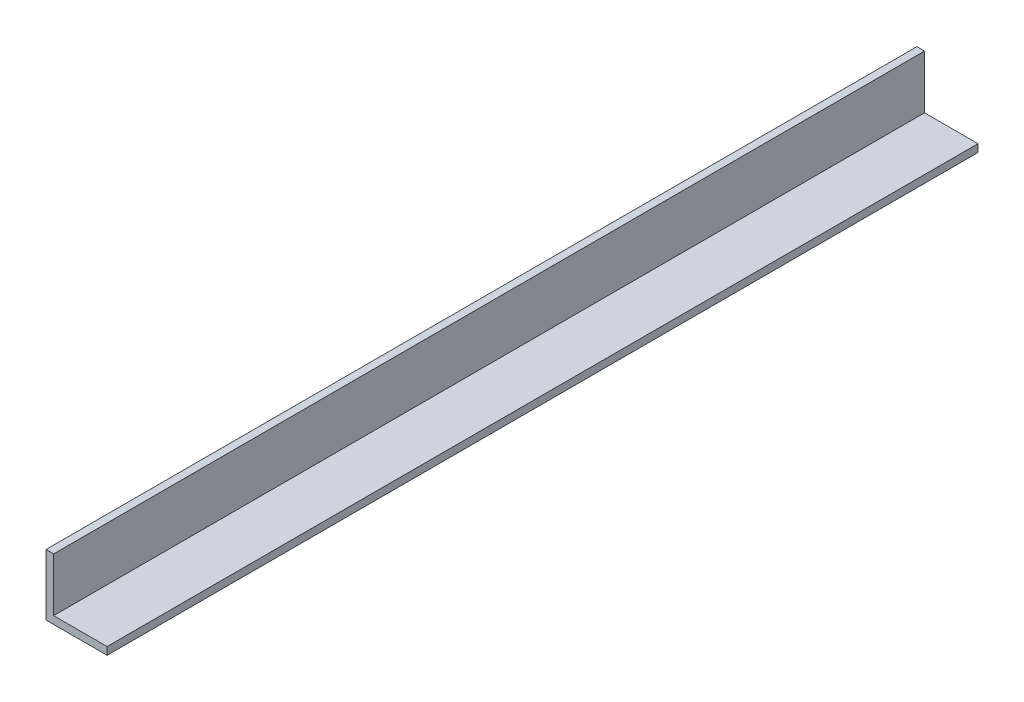
ISO-10303-21;
HEADER;
FILE_DESCRIPTION(('STEP AP214'),'2;1');
FILE_NAME('part.step','',(''),(''),'','','');
FILE_SCHEMA(('AUTOMOTIVE_DESIGN { 1 0 10303 214 1 1 1 1 }'));
ENDSEC;
DATA;
#1=APPLICATION_CONTEXT('core data for automotive mechanical design processes');
#2=APPLICATION_PROTOCOL_DEFINITION('international standard','automotive_design',2000,#1);
#3=PRODUCT_CONTEXT('',#1,'mechanical');
#4=PRODUCT('Part','Part','',(#3));
#5=PRODUCT_RELATED_PRODUCT_CATEGORY('part','',(#4));
#6=PRODUCT_DEFINITION_FORMATION('','',#4);
#7=PRODUCT_DEFINITION_CONTEXT('part definition',#1,'design');
#8=PRODUCT_DEFINITION('design','',#6,#7);
#9=PRODUCT_DEFINITION_SHAPE('','',#8);
#10=(LENGTH_UNIT() NAMED_UNIT(*) SI_UNIT(.MILLI.,.METRE.));
#11=(NAMED_UNIT(*) PLANE_ANGLE_UNIT() SI_UNIT($,.RADIAN.));
#12=(NAMED_UNIT(*) SI_UNIT($,.STERADIAN.) SOLID_ANGLE_UNIT());
#13=UNCERTAINTY_MEASURE_WITH_UNIT(LENGTH_MEASURE(1.E-05),#10,'distance_accuracy_value','');
#14=(GEOMETRIC_REPRESENTATION_CONTEXT(3) GLOBAL_UNCERTAINTY_ASSIGNED_CONTEXT((#13)) GLOBAL_UNIT_ASSIGNED_CONTEXT((#10,
#11,#12)) REPRESENTATION_CONTEXT('',''));
#15=CARTESIAN_POINT('',(0.,0.,0.));
#16=DIRECTION('',(0.,0.,1.));
#17=DIRECTION('',(1.,0.,0.));
#18=AXIS2_PLACEMENT_3D('',#15,#16,#17);
#19=CARTESIAN_POINT('',(3.175,25.4,180.975));
#20=DIRECTION('',(0.,-1.,0.));
#21=DIRECTION('',(0.,0.,-1.));
#22=AXIS2_PLACEMENT_3D('',#19,#20,#21);
#23=PLANE('',#22);
#24=DIRECTION('',(-1.,0.,0.));
#25=VECTOR('',#24,1.);
#26=CARTESIAN_POINT('',(3.175,25.4,-180.975));
#27=LINE('',#26,#25);
#28=CARTESIAN_POINT('',(3.175,25.4,-180.975));
#29=VERTEX_POINT('',#28);
#30=CARTESIAN_POINT('',(0.,25.4,-180.975));
#31=VERTEX_POINT('',#30);
#32=EDGE_CURVE('E125',#29,#31,#27,.T.);
#33=ORIENTED_EDGE('',*,*,#32,.T.);
#34=DIRECTION('',(0.,0.,-1.));
#35=VECTOR('',#34,1.);
#36=CARTESIAN_POINT('',(0.,25.4,180.975));
#37=LINE('',#36,#35);
#38=CARTESIAN_POINT('',(0.,25.4,180.975));
#39=VERTEX_POINT('',#38);
#40=EDGE_CURVE('E11',#39,#31,#37,.T.);
#41=ORIENTED_EDGE('',*,*,#40,.F.);
#42=DIRECTION('',(-1.,0.,0.));
#43=VECTOR('',#42,1.);
#44=CARTESIAN_POINT('',(3.175,25.4,180.975));
#45=LINE('',#44,#43);
#46=CARTESIAN_POINT('',(3.175,25.4,180.975));
#47=VERTEX_POINT('',#46);
#48=EDGE_CURVE('E135',#47,#39,#45,.T.);
#49=ORIENTED_EDGE('',*,*,#48,.F.);
#50=DIRECTION('',(0.,0.,-1.));
#51=VECTOR('',#50,1.);
#52=CARTESIAN_POINT('',(3.175,25.4,180.975));
#53=LINE('',#52,#51);
#54=EDGE_CURVE('E121',#47,#29,#53,.T.);
#55=ORIENTED_EDGE('',*,*,#54,.T.);
#56=EDGE_LOOP('',(#33,#41,#49,#55));
#57=FACE_BOUND('',#56,.T.);
#58=ADVANCED_FACE('F41',(#57),#23,.F.);
#59=CARTESIAN_POINT('',(0.,25.4,180.975));
#60=DIRECTION('',(1.,0.,0.));
#61=DIRECTION('',(0.,0.,-1.));
#62=AXIS2_PLACEMENT_3D('',#59,#60,#61);
#63=PLANE('',#62);
#64=DIRECTION('',(0.,-1.,0.));
#65=VECTOR('',#64,1.);
#66=CARTESIAN_POINT('',(0.,25.4,-180.975));
#67=LINE('',#66,#65);
#68=CARTESIAN_POINT('',(0.,0.,-180.975));
#69=VERTEX_POINT('',#68);
#70=EDGE_CURVE('E128',#31,#69,#67,.T.);
#71=ORIENTED_EDGE('',*,*,#70,.T.);
#72=DIRECTION('',(0.,0.,-1.));
#73=VECTOR('',#72,1.);
#74=CARTESIAN_POINT('',(0.,0.,180.975));
#75=LINE('',#74,#73);
#76=CARTESIAN_POINT('',(0.,0.,180.975));
#77=VERTEX_POINT('',#76);
#78=EDGE_CURVE('E49',#77,#69,#75,.T.);
#79=ORIENTED_EDGE('',*,*,#78,.F.);
#80=DIRECTION('',(0.,-1.,0.));
#81=VECTOR('',#80,1.);
#82=CARTESIAN_POINT('',(0.,25.4,180.975));
#83=LINE('',#82,#81);
#84=EDGE_CURVE('E94',#39,#77,#83,.T.);
#85=ORIENTED_EDGE('',*,*,#84,.F.);
#86=ORIENTED_EDGE('',*,*,#40,.T.);
#87=EDGE_LOOP('',(#71,#79,#85,#86));
#88=FACE_BOUND('',#87,.T.);
#89=ADVANCED_FACE('F159',(#88),#63,.F.);
#90=CARTESIAN_POINT('',(0.,0.,180.975));
#91=DIRECTION('',(0.,1.,0.));
#92=DIRECTION('',(0.,0.,1.));
#93=AXIS2_PLACEMENT_3D('',#90,#91,#92);
#94=PLANE('',#93);
#95=DIRECTION('',(1.,0.,0.));
#96=VECTOR('',#95,1.);
#97=CARTESIAN_POINT('',(0.,0.,-180.975));
#98=LINE('',#97,#96);
#99=CARTESIAN_POINT('',(25.4,0.,-180.975));
#100=VERTEX_POINT('',#99);
#101=EDGE_CURVE('E130',#69,#100,#98,.T.);
#102=ORIENTED_EDGE('',*,*,#101,.T.);
#103=DIRECTION('',(0.,0.,-1.));
#104=VECTOR('',#103,1.);
#105=CARTESIAN_POINT('',(25.4,0.,180.975));
#106=LINE('',#105,#104);
#107=CARTESIAN_POINT('',(25.4,0.,180.975));
#108=VERTEX_POINT('',#107);
#109=EDGE_CURVE('E116',#108,#100,#106,.T.);
#110=ORIENTED_EDGE('',*,*,#109,.F.);
#111=DIRECTION('',(1.,0.,0.));
#112=VECTOR('',#111,1.);
#113=CARTESIAN_POINT('',(0.,0.,180.975));
#114=LINE('',#113,#112);
#115=EDGE_CURVE('E107',#77,#108,#114,.T.);
#116=ORIENTED_EDGE('',*,*,#115,.F.);
#117=ORIENTED_EDGE('',*,*,#78,.T.);
#118=EDGE_LOOP('',(#102,#110,#116,#117));
#119=FACE_BOUND('',#118,.T.);
#120=ADVANCED_FACE('F141',(#119),#94,.F.);
#121=CARTESIAN_POINT('',(25.4,0.,180.975));
#122=DIRECTION('',(-1.,0.,0.));
#123=DIRECTION('',(0.,0.,1.));
#124=AXIS2_PLACEMENT_3D('',#121,#122,#123);
#125=PLANE('',#124);
#126=DIRECTION('',(0.,1.,0.));
#127=VECTOR('',#126,1.);
#128=CARTESIAN_POINT('',(25.4,0.,-180.975));
#129=LINE('',#128,#127);
#130=CARTESIAN_POINT('',(25.4,3.175,-180.975));
#131=VERTEX_POINT('',#130);
#132=EDGE_CURVE('E115',#100,#131,#129,.T.);
#133=ORIENTED_EDGE('',*,*,#132,.T.);
#134=DIRECTION('',(0.,0.,-1.));
#135=VECTOR('',#134,1.);
#136=CARTESIAN_POINT('',(25.4,3.175,180.975));
#137=LINE('',#136,#135);
#138=CARTESIAN_POINT('',(25.4,3.175,180.975));
#139=VERTEX_POINT('',#138);
#140=EDGE_CURVE('E112',#139,#131,#137,.T.);
#141=ORIENTED_EDGE('',*,*,#140,.F.);
#142=DIRECTION('',(0.,1.,0.));
#143=VECTOR('',#142,1.);
#144=CARTESIAN_POINT('',(25.4,0.,180.975));
#145=LINE('',#144,#143);
#146=EDGE_CURVE('E101',#108,#139,#145,.T.);
#147=ORIENTED_EDGE('',*,*,#146,.F.);
#148=ORIENTED_EDGE('',*,*,#109,.T.);
#149=EDGE_LOOP('',(#133,#141,#147,#148));
#150=FACE_BOUND('',#149,.T.);
#151=ADVANCED_FACE('F113',(#150),#125,.F.);
#152=CARTESIAN_POINT('',(25.4,3.175,180.975));
#153=DIRECTION('',(0.,-1.,0.));
#154=DIRECTION('',(0.,0.,-1.));
#155=AXIS2_PLACEMENT_3D('',#152,#153,#154);
#156=PLANE('',#155);
#157=DIRECTION('',(-1.,0.,0.));
#158=VECTOR('',#157,1.);
#159=CARTESIAN_POINT('',(25.4,3.175,-180.975));
#160=LINE('',#159,#158);
#161=CARTESIAN_POINT('',(3.175,3.175,-180.975));
#162=VERTEX_POINT('',#161);
#163=EDGE_CURVE('E80',#131,#162,#160,.T.);
#164=ORIENTED_EDGE('',*,*,#163,.T.);
#165=DIRECTION('',(0.,0.,-1.));
#166=VECTOR('',#165,1.);
#167=CARTESIAN_POINT('',(3.175,3.175,180.975));
#168=LINE('',#167,#166);
#169=CARTESIAN_POINT('',(3.175,3.175,180.975));
#170=VERTEX_POINT('',#169);
#171=EDGE_CURVE('E117',#170,#162,#168,.T.);
#172=ORIENTED_EDGE('',*,*,#171,.F.);
#173=DIRECTION('',(-1.,0.,0.));
#174=VECTOR('',#173,1.);
#175=CARTESIAN_POINT('',(25.4,3.175,180.975));
#176=LINE('',#175,#174);
#177=EDGE_CURVE('E105',#139,#170,#176,.T.);
#178=ORIENTED_EDGE('',*,*,#177,.F.);
#179=ORIENTED_EDGE('',*,*,#140,.T.);
#180=EDGE_LOOP('',(#164,#172,#178,#179));
#181=FACE_BOUND('',#180,.T.);
#182=ADVANCED_FACE('F119',(#181),#156,.F.);
#183=CARTESIAN_POINT('',(3.175,3.175,180.975));
#184=DIRECTION('',(-1.,0.,0.));
#185=DIRECTION('',(0.,0.,1.));
#186=AXIS2_PLACEMENT_3D('',#183,#184,#185);
#187=PLANE('',#186);
#188=DIRECTION('',(0.,1.,0.));
#189=VECTOR('',#188,1.);
#190=CARTESIAN_POINT('',(3.175,3.175,-180.975));
#191=LINE('',#190,#189);
#192=EDGE_CURVE('E86',#162,#29,#191,.T.);
#193=ORIENTED_EDGE('',*,*,#192,.T.);
#194=ORIENTED_EDGE('',*,*,#54,.F.);
#195=DIRECTION('',(0.,1.,0.));
#196=VECTOR('',#195,1.);
#197=CARTESIAN_POINT('',(3.175,3.175,180.975));
#198=LINE('',#197,#196);
#199=EDGE_CURVE('E57',#170,#47,#198,.T.);
#200=ORIENTED_EDGE('',*,*,#199,.F.);
#201=ORIENTED_EDGE('',*,*,#171,.T.);
#202=EDGE_LOOP('',(#193,#194,#200,#201));
#203=FACE_BOUND('',#202,.T.);
#204=ADVANCED_FACE('F148',(#203),#187,.F.);
#205=CARTESIAN_POINT('',(0.,0.,180.975));
#206=DIRECTION('',(0.,0.,1.));
#207=DIRECTION('',(1.,0.,0.));
#208=AXIS2_PLACEMENT_3D('',#205,#206,#207);
#209=PLANE('',#208);
#210=ORIENTED_EDGE('',*,*,#48,.T.);
#211=ORIENTED_EDGE('',*,*,#84,.T.);
#212=ORIENTED_EDGE('',*,*,#115,.T.);
#213=ORIENTED_EDGE('',*,*,#146,.T.);
#214=ORIENTED_EDGE('',*,*,#177,.T.);
#215=ORIENTED_EDGE('',*,*,#199,.T.);
#216=EDGE_LOOP('',(#210,#211,#212,#213,#214,#215));
#217=FACE_BOUND('',#216,.T.);
#218=ADVANCED_FACE('F103',(#217),#209,.T.);
#219=CARTESIAN_POINT('',(0.,0.,-180.975));
#220=DIRECTION('',(0.,0.,1.));
#221=DIRECTION('',(1.,0.,0.));
#222=AXIS2_PLACEMENT_3D('',#219,#220,#221);
#223=PLANE('',#222);
#224=ORIENTED_EDGE('',*,*,#32,.F.);
#225=ORIENTED_EDGE('',*,*,#192,.F.);
#226=ORIENTED_EDGE('',*,*,#163,.F.);
#227=ORIENTED_EDGE('',*,*,#132,.F.);
#228=ORIENTED_EDGE('',*,*,#101,.F.);
#229=ORIENTED_EDGE('',*,*,#70,.F.);
#230=EDGE_LOOP('',(#224,#225,#226,#227,#228,#229));
#231=FACE_BOUND('',#230,.T.);
#232=ADVANCED_FACE('F144',(#231),#223,.F.);
#233=CLOSED_SHELL('',(#58,#89,#120,#151,#182,#204,#218,#232));
#234=MANIFOLD_SOLID_BREP('B2',#233);
#235=ADVANCED_BREP_SHAPE_REPRESENTATION('',(#18,#234),#14);
#236=SHAPE_DEFINITION_REPRESENTATION(#9,#235);
ENDSEC;
END-ISO-10303-21;
